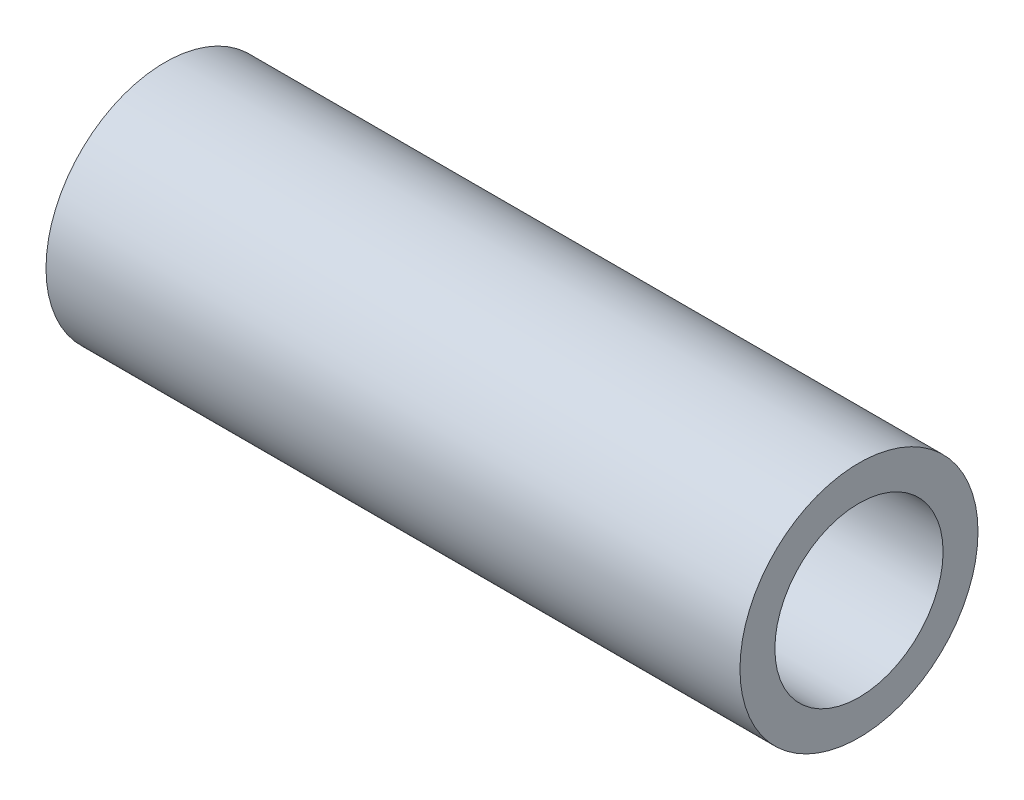
ISO-10303-21;
HEADER;
FILE_DESCRIPTION(('STEP AP214'),'2;1');
FILE_NAME('part.step','',(''),(''),'','','');
FILE_SCHEMA(('AUTOMOTIVE_DESIGN { 1 0 10303 214 1 1 1 1 }'));
ENDSEC;
DATA;
#1=APPLICATION_CONTEXT('core data for automotive mechanical design processes');
#2=APPLICATION_PROTOCOL_DEFINITION('international standard','automotive_design',2000,#1);
#3=PRODUCT_CONTEXT('',#1,'mechanical');
#4=PRODUCT('Part','Part','',(#3));
#5=PRODUCT_RELATED_PRODUCT_CATEGORY('part','',(#4));
#6=PRODUCT_DEFINITION_FORMATION('','',#4);
#7=PRODUCT_DEFINITION_CONTEXT('part definition',#1,'design');
#8=PRODUCT_DEFINITION('design','',#6,#7);
#9=PRODUCT_DEFINITION_SHAPE('','',#8);
#10=(LENGTH_UNIT() NAMED_UNIT(*) SI_UNIT(.MILLI.,.METRE.));
#11=(NAMED_UNIT(*) PLANE_ANGLE_UNIT() SI_UNIT($,.RADIAN.));
#12=(NAMED_UNIT(*) SI_UNIT($,.STERADIAN.) SOLID_ANGLE_UNIT());
#13=UNCERTAINTY_MEASURE_WITH_UNIT(LENGTH_MEASURE(1.E-05),#10,'distance_accuracy_value','');
#14=(GEOMETRIC_REPRESENTATION_CONTEXT(3) GLOBAL_UNCERTAINTY_ASSIGNED_CONTEXT((#13)) GLOBAL_UNIT_ASSIGNED_CONTEXT((#10,
#11,#12)) REPRESENTATION_CONTEXT('',''));
#15=CARTESIAN_POINT('',(0.,0.,0.));
#16=DIRECTION('',(0.,0.,1.));
#17=DIRECTION('',(1.,0.,0.));
#18=AXIS2_PLACEMENT_3D('',#15,#16,#17);
#19=CARTESIAN_POINT('',(28.8798,0.,0.));
#20=DIRECTION('',(-1.,0.,0.));
#21=DIRECTION('',(0.,0.,1.));
#22=AXIS2_PLACEMENT_3D('',#19,#20,#21);
#23=CYLINDRICAL_SURFACE('',#22,3.5);
#24=CARTESIAN_POINT('',(0.,0.,0.));
#25=DIRECTION('',(-1.,0.,0.));
#26=DIRECTION('',(0.,0.,1.));
#27=AXIS2_PLACEMENT_3D('',#24,#25,#26);
#28=CIRCLE('',#27,3.5);
#29=CARTESIAN_POINT('',(0.,0.,3.5));
#30=VERTEX_POINT('',#29);
#31=EDGE_CURVE('E27',#30,#30,#28,.T.);
#32=ORIENTED_EDGE('',*,*,#31,.T.);
#33=EDGE_LOOP('',(#32));
#34=FACE_BOUND('',#33,.T.);
#35=CARTESIAN_POINT('',(28.8798,0.,0.));
#36=DIRECTION('',(-1.,0.,0.));
#37=DIRECTION('',(0.,0.,1.));
#38=AXIS2_PLACEMENT_3D('',#35,#36,#37);
#39=CIRCLE('',#38,3.5);
#40=CARTESIAN_POINT('',(28.8798,0.,3.5));
#41=VERTEX_POINT('',#40);
#42=EDGE_CURVE('E18',#41,#41,#39,.T.);
#43=ORIENTED_EDGE('',*,*,#42,.F.);
#44=EDGE_LOOP('',(#43));
#45=FACE_BOUND('',#44,.T.);
#46=ADVANCED_FACE('F15',(#34,#45),#23,.F.);
#47=CARTESIAN_POINT('',(28.8798,0.,0.));
#48=DIRECTION('',(1.,0.,0.));
#49=DIRECTION('',(0.,0.,-1.));
#50=AXIS2_PLACEMENT_3D('',#47,#48,#49);
#51=PLANE('',#50);
#52=ORIENTED_EDGE('',*,*,#42,.T.);
#53=EDGE_LOOP('',(#52));
#54=FACE_BOUND('',#53,.T.);
#55=CARTESIAN_POINT('',(28.8798,0.,0.));
#56=DIRECTION('',(-1.,0.,0.));
#57=DIRECTION('',(0.,0.,1.));
#58=AXIS2_PLACEMENT_3D('',#55,#56,#57);
#59=CIRCLE('',#58,4.953);
#60=CARTESIAN_POINT('',(28.8798,0.,4.953));
#61=VERTEX_POINT('',#60);
#62=EDGE_CURVE('E22',#61,#61,#59,.T.);
#63=ORIENTED_EDGE('',*,*,#62,.F.);
#64=EDGE_LOOP('',(#63));
#65=FACE_BOUND('',#64,.T.);
#66=ADVANCED_FACE('F35',(#54,#65),#51,.T.);
#67=CARTESIAN_POINT('',(0.,0.,0.));
#68=DIRECTION('',(1.,0.,0.));
#69=DIRECTION('',(0.,0.,-1.));
#70=AXIS2_PLACEMENT_3D('',#67,#68,#69);
#71=PLANE('',#70);
#72=ORIENTED_EDGE('',*,*,#31,.F.);
#73=EDGE_LOOP('',(#72));
#74=FACE_BOUND('',#73,.T.);
#75=CARTESIAN_POINT('',(0.,0.,0.));
#76=DIRECTION('',(-1.,0.,0.));
#77=DIRECTION('',(0.,0.,1.));
#78=AXIS2_PLACEMENT_3D('',#75,#76,#77);
#79=CIRCLE('',#78,4.953);
#80=CARTESIAN_POINT('',(0.,0.,4.953));
#81=VERTEX_POINT('',#80);
#82=EDGE_CURVE('E10',#81,#81,#79,.F.);
#83=ORIENTED_EDGE('',*,*,#82,.F.);
#84=EDGE_LOOP('',(#83));
#85=FACE_BOUND('',#84,.T.);
#86=ADVANCED_FACE('F43',(#74,#85),#71,.F.);
#87=CARTESIAN_POINT('',(28.8798,0.,0.));
#88=DIRECTION('',(-1.,0.,0.));
#89=DIRECTION('',(0.,0.,1.));
#90=AXIS2_PLACEMENT_3D('',#87,#88,#89);
#91=CYLINDRICAL_SURFACE('',#90,4.953);
#92=ORIENTED_EDGE('',*,*,#82,.T.);
#93=EDGE_LOOP('',(#92));
#94=FACE_BOUND('',#93,.T.);
#95=ORIENTED_EDGE('',*,*,#62,.T.);
#96=EDGE_LOOP('',(#95));
#97=FACE_BOUND('',#96,.T.);
#98=ADVANCED_FACE('F44',(#94,#97),#91,.T.);
#99=CLOSED_SHELL('',(#46,#66,#86,#98));
#100=MANIFOLD_SOLID_BREP('B1',#99);
#101=ADVANCED_BREP_SHAPE_REPRESENTATION('',(#18,#100),#14);
#102=SHAPE_DEFINITION_REPRESENTATION(#9,#101);
ENDSEC;
END-ISO-10303-21;
